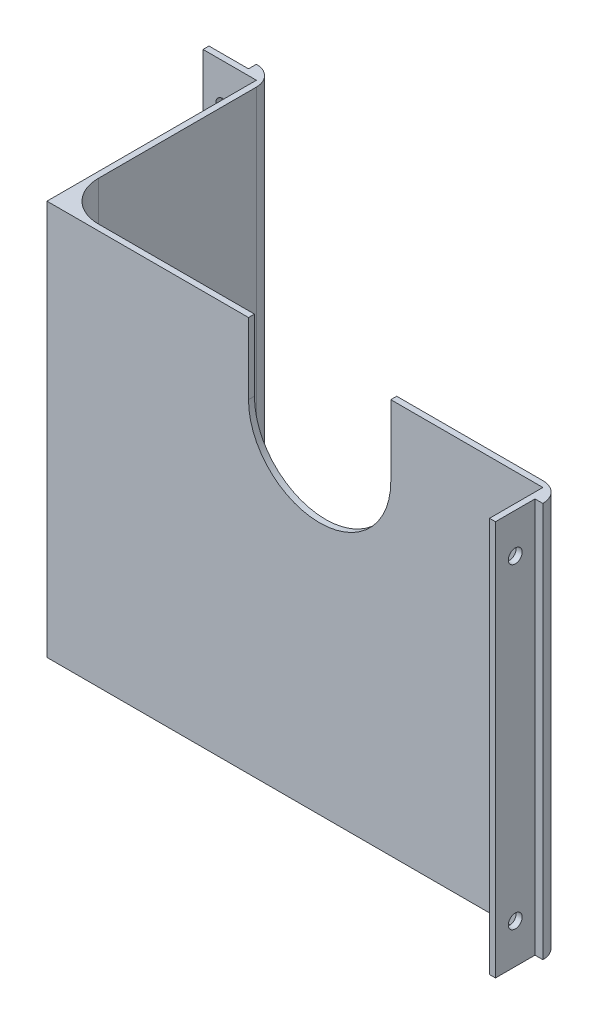
ISO-10303-21;
HEADER;
FILE_DESCRIPTION(('STEP AP214'),'2;1');
FILE_NAME('part.step','',(''),(''),'','','');
FILE_SCHEMA(('AUTOMOTIVE_DESIGN { 1 0 10303 214 1 1 1 1 }'));
ENDSEC;
DATA;
#1=APPLICATION_CONTEXT('core data for automotive mechanical design processes');
#2=APPLICATION_PROTOCOL_DEFINITION('international standard','automotive_design',2000,#1);
#3=PRODUCT_CONTEXT('',#1,'mechanical');
#4=PRODUCT('Part','Part','',(#3));
#5=PRODUCT_RELATED_PRODUCT_CATEGORY('part','',(#4));
#6=PRODUCT_DEFINITION_FORMATION('','',#4);
#7=PRODUCT_DEFINITION_CONTEXT('part definition',#1,'design');
#8=PRODUCT_DEFINITION('design','',#6,#7);
#9=PRODUCT_DEFINITION_SHAPE('','',#8);
#10=(LENGTH_UNIT() NAMED_UNIT(*) SI_UNIT(.MILLI.,.METRE.));
#11=(NAMED_UNIT(*) PLANE_ANGLE_UNIT() SI_UNIT($,.RADIAN.));
#12=(NAMED_UNIT(*) SI_UNIT($,.STERADIAN.) SOLID_ANGLE_UNIT());
#13=UNCERTAINTY_MEASURE_WITH_UNIT(LENGTH_MEASURE(1.E-05),#10,'distance_accuracy_value','');
#14=(GEOMETRIC_REPRESENTATION_CONTEXT(3) GLOBAL_UNCERTAINTY_ASSIGNED_CONTEXT((#13)) GLOBAL_UNIT_ASSIGNED_CONTEXT((#10,
#11,#12)) REPRESENTATION_CONTEXT('',''));
#15=CARTESIAN_POINT('',(0.,0.,0.));
#16=DIRECTION('',(0.,0.,1.));
#17=DIRECTION('',(1.,0.,0.));
#18=AXIS2_PLACEMENT_3D('',#15,#16,#17);
#19=CARTESIAN_POINT('',(-6.10622663543836E-13,100.,4.99999999999999));
#20=DIRECTION('',(0.,1.,0.));
#21=DIRECTION('',(0.,0.,-1.));
#22=AXIS2_PLACEMENT_3D('',#19,#20,#21);
#23=PLANE('',#22);
#24=DIRECTION('',(0.,0.,-1.));
#25=VECTOR('',#24,1.);
#26=CARTESIAN_POINT('',(-73.,100.,5.));
#27=LINE('',#26,#25);
#28=CARTESIAN_POINT('',(-73.,100.,1.5));
#29=VERTEX_POINT('',#28);
#30=CARTESIAN_POINT('',(-73.0000000000003,100.,0.));
#31=VERTEX_POINT('',#30);
#32=EDGE_CURVE('E11',#29,#31,#27,.T.);
#33=ORIENTED_EDGE('',*,*,#32,.T.);
#34=DIRECTION('',(1.,0.,0.));
#35=VECTOR('',#34,1.);
#36=CARTESIAN_POINT('',(0.,100.,0.));
#37=LINE('',#36,#35);
#38=CARTESIAN_POINT('',(-112.5,100.,0.));
#39=VERTEX_POINT('',#38);
#40=EDGE_CURVE('E185',#39,#31,#37,.T.);
#41=ORIENTED_EDGE('',*,*,#40,.F.);
#42=CARTESIAN_POINT('',(-112.5,100.,-10.));
#43=DIRECTION('',(0.,1.,0.));
#44=DIRECTION('',(0.,0.,-1.));
#45=AXIS2_PLACEMENT_3D('',#42,#43,#44);
#46=CIRCLE('',#45,9.99999999999999);
#47=CARTESIAN_POINT('',(-122.5,100.,-9.99999999999999));
#48=VERTEX_POINT('',#47);
#49=EDGE_CURVE('E167',#48,#39,#46,.T.);
#50=ORIENTED_EDGE('',*,*,#49,.F.);
#51=DIRECTION('',(0.,0.,1.));
#52=VECTOR('',#51,1.);
#53=CARTESIAN_POINT('',(-122.5,100.,-10.));
#54=LINE('',#53,#52);
#55=CARTESIAN_POINT('',(-122.5,100.,-50.));
#56=VERTEX_POINT('',#55);
#57=EDGE_CURVE('E176',#56,#48,#54,.T.);
#58=ORIENTED_EDGE('',*,*,#57,.F.);
#59=CARTESIAN_POINT('',(-127.5,100.,-50.));
#60=DIRECTION('',(0.,-1.,0.));
#61=DIRECTION('',(0.,0.,1.));
#62=AXIS2_PLACEMENT_3D('',#59,#60,#61);
#63=CIRCLE('',#62,5.00000000000001);
#64=CARTESIAN_POINT('',(-127.5,100.,-55.));
#65=VERTEX_POINT('',#64);
#66=EDGE_CURVE('E182',#65,#56,#63,.T.);
#67=ORIENTED_EDGE('',*,*,#66,.F.);
#68=DIRECTION('',(0.,0.,-1.));
#69=VECTOR('',#68,1.);
#70=CARTESIAN_POINT('',(-127.5,100.,-55.));
#71=LINE('',#70,#69);
#72=CARTESIAN_POINT('',(-127.5,100.,-53.));
#73=VERTEX_POINT('',#72);
#74=EDGE_CURVE('E334',#73,#65,#71,.T.);
#75=ORIENTED_EDGE('',*,*,#74,.F.);
#76=DIRECTION('',(1.,0.,0.));
#77=VECTOR('',#76,1.);
#78=CARTESIAN_POINT('',(-127.5,100.,-53.));
#79=LINE('',#78,#77);
#80=CARTESIAN_POINT('',(-137.5,100.,-53.));
#81=VERTEX_POINT('',#80);
#82=EDGE_CURVE('E331',#81,#73,#79,.T.);
#83=ORIENTED_EDGE('',*,*,#82,.F.);
#84=DIRECTION('',(0.,0.,-1.));
#85=VECTOR('',#84,1.);
#86=CARTESIAN_POINT('',(-137.5,100.,-53.));
#87=LINE('',#86,#85);
#88=CARTESIAN_POINT('',(-137.5,100.,-51.5));
#89=VERTEX_POINT('',#88);
#90=EDGE_CURVE('E328',#89,#81,#87,.T.);
#91=ORIENTED_EDGE('',*,*,#90,.F.);
#92=DIRECTION('',(-1.,0.,0.));
#93=VECTOR('',#92,1.);
#94=CARTESIAN_POINT('',(-137.5,100.,-51.5));
#95=LINE('',#94,#93);
#96=CARTESIAN_POINT('',(-124.,100.,-51.5));
#97=VERTEX_POINT('',#96);
#98=EDGE_CURVE('E325',#97,#89,#95,.T.);
#99=ORIENTED_EDGE('',*,*,#98,.F.);
#100=DIRECTION('',(0.,0.,-1.));
#101=VECTOR('',#100,1.);
#102=CARTESIAN_POINT('',(-124.,100.,-51.5));
#103=LINE('',#102,#101);
#104=CARTESIAN_POINT('',(-124.,100.,1.49999999999999));
#105=VERTEX_POINT('',#104);
#106=EDGE_CURVE('E322',#105,#97,#103,.T.);
#107=ORIENTED_EDGE('',*,*,#106,.F.);
#108=DIRECTION('',(-1.,0.,0.));
#109=VECTOR('',#108,1.);
#110=CARTESIAN_POINT('',(-124.,100.,1.49999999999999));
#111=LINE('',#110,#109);
#112=EDGE_CURVE('E318',#29,#105,#111,.T.);
#113=ORIENTED_EDGE('',*,*,#112,.F.);
#114=EDGE_LOOP('',(#33,#41,#50,#58,#67,#75,#83,#91,#99,#107,#113));
#115=FACE_BOUND('',#114,.T.);
#116=ADVANCED_FACE('F37',(#115),#23,.T.);
#117=CARTESIAN_POINT('',(-6.10622663543836E-13,100.,4.99999999999999));
#118=DIRECTION('',(0.,-1.,0.));
#119=DIRECTION('',(0.,0.,1.));
#120=AXIS2_PLACEMENT_3D('',#117,#118,#119);
#121=CYLINDRICAL_SURFACE('',#120,5.);
#122=CARTESIAN_POINT('',(-6.10622663543836E-13,3.05311331771918E-13,5.));
#123=DIRECTION('',(0.,-1.,0.));
#124=DIRECTION('',(0.,0.,-1.));
#125=AXIS2_PLACEMENT_3D('',#122,#123,#124);
#126=CIRCLE('',#125,5.);
#127=CARTESIAN_POINT('',(0.,0.,0.));
#128=VERTEX_POINT('',#127);
#129=CARTESIAN_POINT('',(4.99999999999939,3.05311331771918E-13,5.00000000000002));
#130=VERTEX_POINT('',#129);
#131=EDGE_CURVE('E191',#128,#130,#126,.T.);
#132=ORIENTED_EDGE('',*,*,#131,.F.);
#133=DIRECTION('',(0.,-1.,0.));
#134=VECTOR('',#133,1.);
#135=CARTESIAN_POINT('',(0.,100.,0.));
#136=LINE('',#135,#134);
#137=CARTESIAN_POINT('',(0.,100.,0.));
#138=VERTEX_POINT('',#137);
#139=EDGE_CURVE('E190',#138,#128,#136,.T.);
#140=ORIENTED_EDGE('',*,*,#139,.F.);
#141=CARTESIAN_POINT('',(-6.10622663543836E-13,100.,4.99999999999999));
#142=DIRECTION('',(0.,-1.,0.));
#143=DIRECTION('',(0.,0.,-1.));
#144=AXIS2_PLACEMENT_3D('',#141,#142,#143);
#145=CIRCLE('',#144,5.);
#146=CARTESIAN_POINT('',(4.99999999999939,100.,5.));
#147=VERTEX_POINT('',#146);
#148=EDGE_CURVE('E231',#138,#147,#145,.T.);
#149=ORIENTED_EDGE('',*,*,#148,.T.);
#150=DIRECTION('',(0.,-1.,0.));
#151=VECTOR('',#150,1.);
#152=CARTESIAN_POINT('',(4.99999999999939,100.,5.));
#153=LINE('',#152,#151);
#154=EDGE_CURVE('E265',#147,#130,#153,.T.);
#155=ORIENTED_EDGE('',*,*,#154,.T.);
#156=EDGE_LOOP('',(#132,#140,#149,#155));
#157=FACE_BOUND('',#156,.T.);
#158=ADVANCED_FACE('F39',(#157),#121,.T.);
#159=CARTESIAN_POINT('',(4.99999999999939,100.,5.));
#160=DIRECTION('',(0.,0.,-1.));
#161=DIRECTION('',(1.,0.,0.));
#162=AXIS2_PLACEMENT_3D('',#159,#160,#161);
#163=PLANE('',#162);
#164=DIRECTION('',(-1.,0.,0.));
#165=VECTOR('',#164,1.);
#166=CARTESIAN_POINT('',(4.99999999999939,3.05311331771918E-13,5.00000000000002));
#167=LINE('',#166,#165);
#168=CARTESIAN_POINT('',(2.99999999999939,3.05311331771918E-13,5.));
#169=VERTEX_POINT('',#168);
#170=EDGE_CURVE('E193',#130,#169,#167,.T.);
#171=ORIENTED_EDGE('',*,*,#170,.F.);
#172=ORIENTED_EDGE('',*,*,#154,.F.);
#173=DIRECTION('',(-1.,0.,0.));
#174=VECTOR('',#173,1.);
#175=CARTESIAN_POINT('',(4.99999999999939,100.,5.));
#176=LINE('',#175,#174);
#177=CARTESIAN_POINT('',(2.99999999999939,100.,5.));
#178=VERTEX_POINT('',#177);
#179=EDGE_CURVE('E123',#147,#178,#176,.T.);
#180=ORIENTED_EDGE('',*,*,#179,.T.);
#181=DIRECTION('',(0.,-1.,0.));
#182=VECTOR('',#181,1.);
#183=CARTESIAN_POINT('',(2.99999999999939,100.,5.));
#184=LINE('',#183,#182);
#185=EDGE_CURVE('E262',#178,#169,#184,.T.);
#186=ORIENTED_EDGE('',*,*,#185,.T.);
#187=EDGE_LOOP('',(#171,#172,#180,#186));
#188=FACE_BOUND('',#187,.T.);
#189=ADVANCED_FACE('F406',(#188),#163,.F.);
#190=CARTESIAN_POINT('',(2.99999999999939,100.,5.));
#191=DIRECTION('',(-1.,0.,0.));
#192=DIRECTION('',(0.,0.,-1.));
#193=AXIS2_PLACEMENT_3D('',#190,#191,#192);
#194=PLANE('',#193);
#195=CARTESIAN_POINT('',(2.99999999999998,90.,10.));
#196=DIRECTION('',(-1.,0.,0.));
#197=DIRECTION('',(0.,0.,1.));
#198=AXIS2_PLACEMENT_3D('',#195,#196,#197);
#199=CIRCLE('',#198,1.75);
#200=CARTESIAN_POINT('',(2.99999999999998,90.,11.75));
#201=VERTEX_POINT('',#200);
#202=EDGE_CURVE('E270',#201,#201,#199,.T.);
#203=ORIENTED_EDGE('',*,*,#202,.T.);
#204=EDGE_LOOP('',(#203));
#205=FACE_BOUND('',#204,.T.);
#206=CARTESIAN_POINT('',(2.99999999999998,9.99999999999999,10.));
#207=DIRECTION('',(-1.,0.,0.));
#208=DIRECTION('',(0.,0.,-1.));
#209=AXIS2_PLACEMENT_3D('',#206,#207,#208);
#210=CIRCLE('',#209,1.75);
#211=CARTESIAN_POINT('',(2.99999999999998,9.99999999999999,8.25000000000002));
#212=VERTEX_POINT('',#211);
#213=EDGE_CURVE('E276',#212,#212,#210,.T.);
#214=ORIENTED_EDGE('',*,*,#213,.T.);
#215=EDGE_LOOP('',(#214));
#216=FACE_BOUND('',#215,.T.);
#217=DIRECTION('',(0.,0.,1.));
#218=VECTOR('',#217,1.);
#219=CARTESIAN_POINT('',(2.99999999999939,3.05311331771918E-13,5.));
#220=LINE('',#219,#218);
#221=CARTESIAN_POINT('',(3.,3.05311331771918E-13,15.));
#222=VERTEX_POINT('',#221);
#223=EDGE_CURVE('E197',#169,#222,#220,.T.);
#224=ORIENTED_EDGE('',*,*,#223,.F.);
#225=ORIENTED_EDGE('',*,*,#185,.F.);
#226=DIRECTION('',(0.,0.,1.));
#227=VECTOR('',#226,1.);
#228=CARTESIAN_POINT('',(2.99999999999939,100.,5.));
#229=LINE('',#228,#227);
#230=CARTESIAN_POINT('',(3.,100.,15.));
#231=VERTEX_POINT('',#230);
#232=EDGE_CURVE('E309',#178,#231,#229,.T.);
#233=ORIENTED_EDGE('',*,*,#232,.T.);
#234=DIRECTION('',(0.,-1.,0.));
#235=VECTOR('',#234,1.);
#236=CARTESIAN_POINT('',(3.,100.,15.));
#237=LINE('',#236,#235);
#238=EDGE_CURVE('E259',#231,#222,#237,.T.);
#239=ORIENTED_EDGE('',*,*,#238,.T.);
#240=EDGE_LOOP('',(#224,#225,#233,#239));
#241=FACE_BOUND('',#240,.T.);
#242=ADVANCED_FACE('F444',(#205,#216,#241),#194,.F.);
#243=CARTESIAN_POINT('',(3.,100.,15.));
#244=DIRECTION('',(0.,0.,-1.));
#245=DIRECTION('',(1.,0.,0.));
#246=AXIS2_PLACEMENT_3D('',#243,#244,#245);
#247=PLANE('',#246);
#248=DIRECTION('',(-1.,0.,0.));
#249=VECTOR('',#248,1.);
#250=CARTESIAN_POINT('',(3.,3.05311331771918E-13,15.));
#251=LINE('',#250,#249);
#252=CARTESIAN_POINT('',(1.5,3.05311331771918E-13,15.));
#253=VERTEX_POINT('',#252);
#254=EDGE_CURVE('E200',#222,#253,#251,.T.);
#255=ORIENTED_EDGE('',*,*,#254,.F.);
#256=ORIENTED_EDGE('',*,*,#238,.F.);
#257=DIRECTION('',(-1.,0.,0.));
#258=VECTOR('',#257,1.);
#259=CARTESIAN_POINT('',(3.,100.,15.));
#260=LINE('',#259,#258);
#261=CARTESIAN_POINT('',(1.5,100.,15.));
#262=VERTEX_POINT('',#261);
#263=EDGE_CURVE('E312',#231,#262,#260,.T.);
#264=ORIENTED_EDGE('',*,*,#263,.T.);
#265=DIRECTION('',(0.,-1.,0.));
#266=VECTOR('',#265,1.);
#267=CARTESIAN_POINT('',(1.5,100.,15.));
#268=LINE('',#267,#266);
#269=EDGE_CURVE('E256',#262,#253,#268,.T.);
#270=ORIENTED_EDGE('',*,*,#269,.T.);
#271=EDGE_LOOP('',(#255,#256,#264,#270));
#272=FACE_BOUND('',#271,.T.);
#273=ADVANCED_FACE('F440',(#272),#247,.F.);
#274=CARTESIAN_POINT('',(1.5,100.,15.));
#275=DIRECTION('',(1.,0.,0.));
#276=DIRECTION('',(0.,0.,1.));
#277=AXIS2_PLACEMENT_3D('',#274,#275,#276);
#278=PLANE('',#277);
#279=CARTESIAN_POINT('',(1.49999999999997,90.,10.));
#280=DIRECTION('',(-1.,0.,0.));
#281=DIRECTION('',(0.,0.,1.));
#282=AXIS2_PLACEMENT_3D('',#279,#280,#281);
#283=CIRCLE('',#282,1.75);
#284=CARTESIAN_POINT('',(1.49999999999997,90.,11.75));
#285=VERTEX_POINT('',#284);
#286=EDGE_CURVE('E41',#285,#285,#283,.T.);
#287=ORIENTED_EDGE('',*,*,#286,.F.);
#288=EDGE_LOOP('',(#287));
#289=FACE_BOUND('',#288,.T.);
#290=CARTESIAN_POINT('',(1.49999999999997,9.99999999999999,10.));
#291=DIRECTION('',(-1.,0.,0.));
#292=DIRECTION('',(0.,0.,1.));
#293=AXIS2_PLACEMENT_3D('',#290,#291,#292);
#294=CIRCLE('',#293,1.75);
#295=CARTESIAN_POINT('',(1.49999999999997,9.99999999999999,11.75));
#296=VERTEX_POINT('',#295);
#297=EDGE_CURVE('E268',#296,#296,#294,.T.);
#298=ORIENTED_EDGE('',*,*,#297,.F.);
#299=EDGE_LOOP('',(#298));
#300=FACE_BOUND('',#299,.T.);
#301=DIRECTION('',(0.,0.,-1.));
#302=VECTOR('',#301,1.);
#303=CARTESIAN_POINT('',(1.5,3.05311331771918E-13,15.));
#304=LINE('',#303,#302);
#305=CARTESIAN_POINT('',(1.49999999999939,3.05311331771918E-13,1.5));
#306=VERTEX_POINT('',#305);
#307=EDGE_CURVE('E203',#253,#306,#304,.T.);
#308=ORIENTED_EDGE('',*,*,#307,.F.);
#309=ORIENTED_EDGE('',*,*,#269,.F.);
#310=DIRECTION('',(0.,0.,-1.));
#311=VECTOR('',#310,1.);
#312=CARTESIAN_POINT('',(1.5,100.,15.));
#313=LINE('',#312,#311);
#314=CARTESIAN_POINT('',(1.49999999999939,100.,1.5));
#315=VERTEX_POINT('',#314);
#316=EDGE_CURVE('E315',#262,#315,#313,.T.);
#317=ORIENTED_EDGE('',*,*,#316,.T.);
#318=DIRECTION('',(0.,-1.,0.));
#319=VECTOR('',#318,1.);
#320=CARTESIAN_POINT('',(1.49999999999939,100.,1.5));
#321=LINE('',#320,#319);
#322=EDGE_CURVE('E253',#315,#306,#321,.T.);
#323=ORIENTED_EDGE('',*,*,#322,.T.);
#324=EDGE_LOOP('',(#308,#309,#317,#323));
#325=FACE_BOUND('',#324,.T.);
#326=ADVANCED_FACE('F375',(#289,#300,#325),#278,.F.);
#327=CARTESIAN_POINT('',(-124.,100.,1.49999999999999));
#328=DIRECTION('',(0.,0.,-1.));
#329=DIRECTION('',(1.,0.,0.));
#330=AXIS2_PLACEMENT_3D('',#327,#328,#329);
#331=PLANE('',#330);
#332=ORIENTED_EDGE('',*,*,#112,.T.);
#333=DIRECTION('',(0.,-1.,0.));
#334=VECTOR('',#333,1.);
#335=CARTESIAN_POINT('',(-124.,100.,1.49999999999999));
#336=LINE('',#335,#334);
#337=CARTESIAN_POINT('',(-124.,3.05311331771918E-13,1.5));
#338=VERTEX_POINT('',#337);
#339=EDGE_CURVE('E250',#105,#338,#336,.T.);
#340=ORIENTED_EDGE('',*,*,#339,.T.);
#341=DIRECTION('',(-1.,0.,0.));
#342=VECTOR('',#341,1.);
#343=CARTESIAN_POINT('',(-124.,3.05311331771918E-13,1.5));
#344=LINE('',#343,#342);
#345=EDGE_CURVE('E206',#306,#338,#344,.T.);
#346=ORIENTED_EDGE('',*,*,#345,.F.);
#347=ORIENTED_EDGE('',*,*,#322,.F.);
#348=CARTESIAN_POINT('',(-37.,100.,1.5));
#349=VERTEX_POINT('',#348);
#350=EDGE_CURVE('E319',#315,#349,#111,.T.);
#351=ORIENTED_EDGE('',*,*,#350,.T.);
#352=DIRECTION('',(0.,1.,0.));
#353=VECTOR('',#352,1.);
#354=CARTESIAN_POINT('',(-37.,100.,1.5));
#355=LINE('',#354,#353);
#356=CARTESIAN_POINT('',(-37.,82.0000017227817,1.5));
#357=VERTEX_POINT('',#356);
#358=EDGE_CURVE('E297',#357,#349,#355,.T.);
#359=ORIENTED_EDGE('',*,*,#358,.F.);
#360=CARTESIAN_POINT('',(-55.,82.0000008613909,1.5));
#361=DIRECTION('',(0.,0.,1.));
#362=DIRECTION('',(1.,0.,0.));
#363=AXIS2_PLACEMENT_3D('',#360,#361,#362);
#364=CIRCLE('',#363,18.);
#365=CARTESIAN_POINT('',(-73.,82.,1.5));
#366=VERTEX_POINT('',#365);
#367=EDGE_CURVE('E194',#366,#357,#364,.T.);
#368=ORIENTED_EDGE('',*,*,#367,.F.);
#369=DIRECTION('',(0.,-1.,0.));
#370=VECTOR('',#369,1.);
#371=CARTESIAN_POINT('',(-73.,100.,1.5));
#372=LINE('',#371,#370);
#373=EDGE_CURVE('E301',#29,#366,#372,.T.);
#374=ORIENTED_EDGE('',*,*,#373,.F.);
#375=EDGE_LOOP('',(#332,#340,#346,#347,#351,#359,#368,#374));
#376=FACE_BOUND('',#375,.T.);
#377=ADVANCED_FACE('F357',(#376),#331,.F.);
#378=CARTESIAN_POINT('',(-124.,100.,-51.5));
#379=DIRECTION('',(1.,0.,0.));
#380=DIRECTION('',(0.,0.,1.));
#381=AXIS2_PLACEMENT_3D('',#378,#379,#380);
#382=PLANE('',#381);
#383=DIRECTION('',(0.,0.,-1.));
#384=VECTOR('',#383,1.);
#385=CARTESIAN_POINT('',(-124.,0.,-51.5));
#386=LINE('',#385,#384);
#387=CARTESIAN_POINT('',(-124.,0.,-51.5));
#388=VERTEX_POINT('',#387);
#389=EDGE_CURVE('E209',#338,#388,#386,.T.);
#390=ORIENTED_EDGE('',*,*,#389,.F.);
#391=ORIENTED_EDGE('',*,*,#339,.F.);
#392=ORIENTED_EDGE('',*,*,#106,.T.);
#393=DIRECTION('',(0.,-1.,0.));
#394=VECTOR('',#393,1.);
#395=CARTESIAN_POINT('',(-124.,100.,-51.5));
#396=LINE('',#395,#394);
#397=EDGE_CURVE('E247',#97,#388,#396,.T.);
#398=ORIENTED_EDGE('',*,*,#397,.T.);
#399=EDGE_LOOP('',(#390,#391,#392,#398));
#400=FACE_BOUND('',#399,.T.);
#401=ADVANCED_FACE('F353',(#400),#382,.F.);
#402=CARTESIAN_POINT('',(-137.5,100.,-51.5));
#403=DIRECTION('',(0.,0.,-1.));
#404=DIRECTION('',(1.,0.,0.));
#405=AXIS2_PLACEMENT_3D('',#402,#403,#404);
#406=PLANE('',#405);
#407=CARTESIAN_POINT('',(-132.5,90.,-51.5));
#408=DIRECTION('',(0.,0.,1.));
#409=DIRECTION('',(1.,0.,0.));
#410=AXIS2_PLACEMENT_3D('',#407,#408,#409);
#411=CIRCLE('',#410,1.75000000000001);
#412=CARTESIAN_POINT('',(-130.75,90.,-51.5));
#413=VERTEX_POINT('',#412);
#414=EDGE_CURVE('E281',#413,#413,#411,.T.);
#415=ORIENTED_EDGE('',*,*,#414,.F.);
#416=EDGE_LOOP('',(#415));
#417=FACE_BOUND('',#416,.T.);
#418=CARTESIAN_POINT('',(-132.5,9.99999999999999,-51.5));
#419=DIRECTION('',(0.,0.,1.));
#420=DIRECTION('',(1.,0.,0.));
#421=AXIS2_PLACEMENT_3D('',#418,#419,#420);
#422=CIRCLE('',#421,1.75000000000001);
#423=CARTESIAN_POINT('',(-130.75,9.99999999999999,-51.5));
#424=VERTEX_POINT('',#423);
#425=EDGE_CURVE('E581',#424,#424,#422,.T.);
#426=ORIENTED_EDGE('',*,*,#425,.F.);
#427=EDGE_LOOP('',(#426));
#428=FACE_BOUND('',#427,.T.);
#429=DIRECTION('',(-1.,0.,0.));
#430=VECTOR('',#429,1.);
#431=CARTESIAN_POINT('',(-137.5,0.,-51.5));
#432=LINE('',#431,#430);
#433=CARTESIAN_POINT('',(-137.5,0.,-51.5));
#434=VERTEX_POINT('',#433);
#435=EDGE_CURVE('E212',#388,#434,#432,.T.);
#436=ORIENTED_EDGE('',*,*,#435,.F.);
#437=ORIENTED_EDGE('',*,*,#397,.F.);
#438=ORIENTED_EDGE('',*,*,#98,.T.);
#439=DIRECTION('',(0.,-1.,0.));
#440=VECTOR('',#439,1.);
#441=CARTESIAN_POINT('',(-137.5,100.,-51.5));
#442=LINE('',#441,#440);
#443=EDGE_CURVE('E244',#89,#434,#442,.T.);
#444=ORIENTED_EDGE('',*,*,#443,.T.);
#445=EDGE_LOOP('',(#436,#437,#438,#444));
#446=FACE_BOUND('',#445,.T.);
#447=ADVANCED_FACE('F351',(#417,#428,#446),#406,.F.);
#448=CARTESIAN_POINT('',(-137.5,100.,-53.));
#449=DIRECTION('',(1.,0.,0.));
#450=DIRECTION('',(0.,0.,1.));
#451=AXIS2_PLACEMENT_3D('',#448,#449,#450);
#452=PLANE('',#451);
#453=DIRECTION('',(0.,0.,-1.));
#454=VECTOR('',#453,1.);
#455=CARTESIAN_POINT('',(-137.5,0.,-53.));
#456=LINE('',#455,#454);
#457=CARTESIAN_POINT('',(-137.5,0.,-53.));
#458=VERTEX_POINT('',#457);
#459=EDGE_CURVE('E215',#434,#458,#456,.T.);
#460=ORIENTED_EDGE('',*,*,#459,.F.);
#461=ORIENTED_EDGE('',*,*,#443,.F.);
#462=ORIENTED_EDGE('',*,*,#90,.T.);
#463=DIRECTION('',(0.,-1.,0.));
#464=VECTOR('',#463,1.);
#465=CARTESIAN_POINT('',(-137.5,100.,-53.));
#466=LINE('',#465,#464);
#467=EDGE_CURVE('E241',#81,#458,#466,.T.);
#468=ORIENTED_EDGE('',*,*,#467,.T.);
#469=EDGE_LOOP('',(#460,#461,#462,#468));
#470=FACE_BOUND('',#469,.T.);
#471=ADVANCED_FACE('F346',(#470),#452,.F.);
#472=CARTESIAN_POINT('',(-127.5,100.,-53.));
#473=DIRECTION('',(0.,0.,1.));
#474=DIRECTION('',(-1.,0.,0.));
#475=AXIS2_PLACEMENT_3D('',#472,#473,#474);
#476=PLANE('',#475);
#477=CARTESIAN_POINT('',(-132.5,90.,-53.0000000000001));
#478=DIRECTION('',(0.,0.,1.));
#479=DIRECTION('',(1.,0.,0.));
#480=AXIS2_PLACEMENT_3D('',#477,#478,#479);
#481=CIRCLE('',#480,1.75000000000001);
#482=CARTESIAN_POINT('',(-130.75,90.,-53.0000000000001));
#483=VERTEX_POINT('',#482);
#484=EDGE_CURVE('E578',#483,#483,#481,.T.);
#485=ORIENTED_EDGE('',*,*,#484,.T.);
#486=EDGE_LOOP('',(#485));
#487=FACE_BOUND('',#486,.T.);
#488=CARTESIAN_POINT('',(-132.5,9.99999999999999,-53.0000000000001));
#489=DIRECTION('',(0.,0.,1.));
#490=DIRECTION('',(-1.,0.,0.));
#491=AXIS2_PLACEMENT_3D('',#488,#489,#490);
#492=CIRCLE('',#491,1.75000000000001);
#493=CARTESIAN_POINT('',(-134.25,9.99999999999999,-53.0000000000001));
#494=VERTEX_POINT('',#493);
#495=EDGE_CURVE('E585',#494,#494,#492,.T.);
#496=ORIENTED_EDGE('',*,*,#495,.T.);
#497=EDGE_LOOP('',(#496));
#498=FACE_BOUND('',#497,.T.);
#499=DIRECTION('',(1.,0.,0.));
#500=VECTOR('',#499,1.);
#501=CARTESIAN_POINT('',(-127.5,0.,-53.));
#502=LINE('',#501,#500);
#503=CARTESIAN_POINT('',(-127.5,0.,-53.));
#504=VERTEX_POINT('',#503);
#505=EDGE_CURVE('E218',#458,#504,#502,.T.);
#506=ORIENTED_EDGE('',*,*,#505,.F.);
#507=ORIENTED_EDGE('',*,*,#467,.F.);
#508=ORIENTED_EDGE('',*,*,#82,.T.);
#509=DIRECTION('',(0.,-1.,0.));
#510=VECTOR('',#509,1.);
#511=CARTESIAN_POINT('',(-127.5,100.,-53.));
#512=LINE('',#511,#510);
#513=EDGE_CURVE('E238',#73,#504,#512,.T.);
#514=ORIENTED_EDGE('',*,*,#513,.T.);
#515=EDGE_LOOP('',(#506,#507,#508,#514));
#516=FACE_BOUND('',#515,.T.);
#517=ADVANCED_FACE('F344',(#487,#498,#516),#476,.F.);
#518=CARTESIAN_POINT('',(-127.5,100.,-55.));
#519=DIRECTION('',(1.,0.,0.));
#520=DIRECTION('',(0.,0.,1.));
#521=AXIS2_PLACEMENT_3D('',#518,#519,#520);
#522=PLANE('',#521);
#523=DIRECTION('',(0.,0.,-1.));
#524=VECTOR('',#523,1.);
#525=CARTESIAN_POINT('',(-127.5,0.,-55.));
#526=LINE('',#525,#524);
#527=CARTESIAN_POINT('',(-127.5,0.,-55.));
#528=VERTEX_POINT('',#527);
#529=EDGE_CURVE('E221',#504,#528,#526,.T.);
#530=ORIENTED_EDGE('',*,*,#529,.F.);
#531=ORIENTED_EDGE('',*,*,#513,.F.);
#532=ORIENTED_EDGE('',*,*,#74,.T.);
#533=DIRECTION('',(0.,-1.,0.));
#534=VECTOR('',#533,1.);
#535=CARTESIAN_POINT('',(-127.5,100.,-55.));
#536=LINE('',#535,#534);
#537=EDGE_CURVE('E235',#65,#528,#536,.T.);
#538=ORIENTED_EDGE('',*,*,#537,.T.);
#539=EDGE_LOOP('',(#530,#531,#532,#538));
#540=FACE_BOUND('',#539,.T.);
#541=ADVANCED_FACE('F342',(#540),#522,.F.);
#542=CARTESIAN_POINT('',(-127.5,100.,-50.));
#543=DIRECTION('',(0.,-1.,0.));
#544=DIRECTION('',(0.,0.,1.));
#545=AXIS2_PLACEMENT_3D('',#542,#543,#544);
#546=CYLINDRICAL_SURFACE('',#545,5.00000000000001);
#547=CARTESIAN_POINT('',(-127.5,3.05311331771918E-13,-50.));
#548=DIRECTION('',(0.,-1.,0.));
#549=DIRECTION('',(0.,0.,1.));
#550=AXIS2_PLACEMENT_3D('',#547,#548,#549);
#551=CIRCLE('',#550,5.00000000000001);
#552=CARTESIAN_POINT('',(-122.5,3.05311331771918E-13,-50.));
#553=VERTEX_POINT('',#552);
#554=EDGE_CURVE('E224',#528,#553,#551,.T.);
#555=ORIENTED_EDGE('',*,*,#554,.F.);
#556=ORIENTED_EDGE('',*,*,#537,.F.);
#557=ORIENTED_EDGE('',*,*,#66,.T.);
#558=DIRECTION('',(0.,-1.,0.));
#559=VECTOR('',#558,1.);
#560=CARTESIAN_POINT('',(-122.5,100.,-50.));
#561=LINE('',#560,#559);
#562=EDGE_CURVE('E172',#56,#553,#561,.T.);
#563=ORIENTED_EDGE('',*,*,#562,.T.);
#564=EDGE_LOOP('',(#555,#556,#557,#563));
#565=FACE_BOUND('',#564,.T.);
#566=ADVANCED_FACE('F337',(#565),#546,.T.);
#567=CARTESIAN_POINT('',(-122.5,100.,-10.));
#568=DIRECTION('',(-1.,0.,0.));
#569=DIRECTION('',(0.,0.,-1.));
#570=AXIS2_PLACEMENT_3D('',#567,#568,#569);
#571=PLANE('',#570);
#572=DIRECTION('',(0.,0.,1.));
#573=VECTOR('',#572,1.);
#574=CARTESIAN_POINT('',(-122.5,0.,-10.));
#575=LINE('',#574,#573);
#576=CARTESIAN_POINT('',(-122.5,0.,-10.));
#577=VERTEX_POINT('',#576);
#578=EDGE_CURVE('E227',#553,#577,#575,.T.);
#579=ORIENTED_EDGE('',*,*,#578,.F.);
#580=ORIENTED_EDGE('',*,*,#562,.F.);
#581=ORIENTED_EDGE('',*,*,#57,.T.);
#582=DIRECTION('',(0.,-1.,0.));
#583=VECTOR('',#582,1.);
#584=CARTESIAN_POINT('',(-122.5,100.,-9.99999999999999));
#585=LINE('',#584,#583);
#586=EDGE_CURVE('E162',#48,#577,#585,.T.);
#587=ORIENTED_EDGE('',*,*,#586,.T.);
#588=EDGE_LOOP('',(#579,#580,#581,#587));
#589=FACE_BOUND('',#588,.T.);
#590=ADVANCED_FACE('F177',(#589),#571,.F.);
#591=CARTESIAN_POINT('',(-112.5,100.,-10.));
#592=DIRECTION('',(0.,-1.,0.));
#593=DIRECTION('',(0.,0.,1.));
#594=AXIS2_PLACEMENT_3D('',#591,#592,#593);
#595=CYLINDRICAL_SURFACE('',#594,9.99999999999999);
#596=CARTESIAN_POINT('',(-112.5,0.,-10.));
#597=DIRECTION('',(0.,1.,0.));
#598=DIRECTION('',(0.,0.,-1.));
#599=AXIS2_PLACEMENT_3D('',#596,#597,#598);
#600=CIRCLE('',#599,9.99999999999999);
#601=CARTESIAN_POINT('',(-112.5,0.,0.));
#602=VERTEX_POINT('',#601);
#603=EDGE_CURVE('E169',#577,#602,#600,.T.);
#604=ORIENTED_EDGE('',*,*,#603,.F.);
#605=ORIENTED_EDGE('',*,*,#586,.F.);
#606=ORIENTED_EDGE('',*,*,#49,.T.);
#607=DIRECTION('',(0.,-1.,0.));
#608=VECTOR('',#607,1.);
#609=CARTESIAN_POINT('',(-112.5,100.,0.));
#610=LINE('',#609,#608);
#611=EDGE_CURVE('E173',#39,#602,#610,.T.);
#612=ORIENTED_EDGE('',*,*,#611,.T.);
#613=EDGE_LOOP('',(#604,#605,#606,#612));
#614=FACE_BOUND('',#613,.T.);
#615=ADVANCED_FACE('F164',(#614),#595,.F.);
#616=CARTESIAN_POINT('',(0.,100.,0.));
#617=DIRECTION('',(0.,0.,1.));
#618=DIRECTION('',(-1.,0.,0.));
#619=AXIS2_PLACEMENT_3D('',#616,#617,#618);
#620=PLANE('',#619);
#621=CARTESIAN_POINT('',(-55.,82.0000008613909,0.));
#622=DIRECTION('',(0.,0.,1.));
#623=DIRECTION('',(1.,0.,0.));
#624=AXIS2_PLACEMENT_3D('',#621,#622,#623);
#625=CIRCLE('',#624,18.);
#626=CARTESIAN_POINT('',(-73.0000000000003,82.,0.));
#627=VERTEX_POINT('',#626);
#628=CARTESIAN_POINT('',(-37.,82.0000017227817,0.));
#629=VERTEX_POINT('',#628);
#630=EDGE_CURVE('E274',#627,#629,#625,.T.);
#631=ORIENTED_EDGE('',*,*,#630,.T.);
#632=DIRECTION('',(0.,1.,0.));
#633=VECTOR('',#632,1.);
#634=CARTESIAN_POINT('',(-37.,100.,0.));
#635=LINE('',#634,#633);
#636=CARTESIAN_POINT('',(-37.,100.,0.));
#637=VERTEX_POINT('',#636);
#638=EDGE_CURVE('E288',#629,#637,#635,.T.);
#639=ORIENTED_EDGE('',*,*,#638,.T.);
#640=EDGE_CURVE('E61',#637,#138,#37,.T.);
#641=ORIENTED_EDGE('',*,*,#640,.T.);
#642=ORIENTED_EDGE('',*,*,#139,.T.);
#643=DIRECTION('',(1.,0.,0.));
#644=VECTOR('',#643,1.);
#645=CARTESIAN_POINT('',(0.,0.,0.));
#646=LINE('',#645,#644);
#647=EDGE_CURVE('E116',#602,#128,#646,.T.);
#648=ORIENTED_EDGE('',*,*,#647,.F.);
#649=ORIENTED_EDGE('',*,*,#611,.F.);
#650=ORIENTED_EDGE('',*,*,#40,.T.);
#651=DIRECTION('',(0.,-1.,0.));
#652=VECTOR('',#651,1.);
#653=CARTESIAN_POINT('',(-73.0000000000003,82.,0.));
#654=LINE('',#653,#652);
#655=EDGE_CURVE('E290',#31,#627,#654,.T.);
#656=ORIENTED_EDGE('',*,*,#655,.T.);
#657=EDGE_LOOP('',(#631,#639,#641,#642,#648,#649,#650,#656));
#658=FACE_BOUND('',#657,.T.);
#659=ADVANCED_FACE('F371',(#658),#620,.F.);
#660=DIRECTION('',(0.,0.,1.));
#661=VECTOR('',#660,1.);
#662=CARTESIAN_POINT('',(-37.0000000000006,100.,5.));
#663=LINE('',#662,#661);
#664=EDGE_CURVE('E46',#637,#349,#663,.T.);
#665=ORIENTED_EDGE('',*,*,#664,.T.);
#666=ORIENTED_EDGE('',*,*,#350,.F.);
#667=ORIENTED_EDGE('',*,*,#316,.F.);
#668=ORIENTED_EDGE('',*,*,#263,.F.);
#669=ORIENTED_EDGE('',*,*,#232,.F.);
#670=ORIENTED_EDGE('',*,*,#179,.F.);
#671=ORIENTED_EDGE('',*,*,#148,.F.);
#672=ORIENTED_EDGE('',*,*,#640,.F.);
#673=EDGE_LOOP('',(#665,#666,#667,#668,#669,#670,#671,#672));
#674=FACE_BOUND('',#673,.T.);
#675=ADVANCED_FACE('F377',(#674),#23,.T.);
#676=CARTESIAN_POINT('',(-6.10622663543836E-13,3.05311331771918E-13,5.));
#677=DIRECTION('',(0.,1.,0.));
#678=DIRECTION('',(0.,0.,-1.));
#679=AXIS2_PLACEMENT_3D('',#676,#677,#678);
#680=PLANE('',#679);
#681=ORIENTED_EDGE('',*,*,#131,.T.);
#682=ORIENTED_EDGE('',*,*,#170,.T.);
#683=ORIENTED_EDGE('',*,*,#223,.T.);
#684=ORIENTED_EDGE('',*,*,#254,.T.);
#685=ORIENTED_EDGE('',*,*,#307,.T.);
#686=ORIENTED_EDGE('',*,*,#345,.T.);
#687=ORIENTED_EDGE('',*,*,#389,.T.);
#688=ORIENTED_EDGE('',*,*,#435,.T.);
#689=ORIENTED_EDGE('',*,*,#459,.T.);
#690=ORIENTED_EDGE('',*,*,#505,.T.);
#691=ORIENTED_EDGE('',*,*,#529,.T.);
#692=ORIENTED_EDGE('',*,*,#554,.T.);
#693=ORIENTED_EDGE('',*,*,#578,.T.);
#694=ORIENTED_EDGE('',*,*,#603,.T.);
#695=ORIENTED_EDGE('',*,*,#647,.T.);
#696=EDGE_LOOP('',(#681,#682,#683,#684,#685,#686,#687,#688,#689,#690,#691,#692,#693,#694,#695));
#697=FACE_BOUND('',#696,.T.);
#698=ADVANCED_FACE('F372',(#697),#680,.F.);
#699=CARTESIAN_POINT('',(-55.,82.0000008613909,10.));
#700=DIRECTION('',(0.,0.,-1.));
#701=DIRECTION('',(1.,0.,0.));
#702=AXIS2_PLACEMENT_3D('',#699,#700,#701);
#703=CYLINDRICAL_SURFACE('',#702,18.);
#704=DIRECTION('',(0.,0.,-1.));
#705=VECTOR('',#704,1.);
#706=CARTESIAN_POINT('',(-73.0000000000003,82.,10.));
#707=LINE('',#706,#705);
#708=EDGE_CURVE('E294',#366,#627,#707,.T.);
#709=ORIENTED_EDGE('',*,*,#708,.F.);
#710=ORIENTED_EDGE('',*,*,#367,.T.);
#711=DIRECTION('',(0.,0.,-1.));
#712=VECTOR('',#711,1.);
#713=CARTESIAN_POINT('',(-37.,82.0000017227817,10.));
#714=LINE('',#713,#712);
#715=EDGE_CURVE('E293',#357,#629,#714,.T.);
#716=ORIENTED_EDGE('',*,*,#715,.T.);
#717=ORIENTED_EDGE('',*,*,#630,.F.);
#718=EDGE_LOOP('',(#709,#710,#716,#717));
#719=FACE_BOUND('',#718,.T.);
#720=ADVANCED_FACE('F387',(#719),#703,.F.);
#721=CARTESIAN_POINT('',(-73.0000000000003,82.,10.));
#722=DIRECTION('',(-1.,0.,0.));
#723=DIRECTION('',(0.,0.,-1.));
#724=AXIS2_PLACEMENT_3D('',#721,#722,#723);
#725=PLANE('',#724);
#726=ORIENTED_EDGE('',*,*,#32,.F.);
#727=ORIENTED_EDGE('',*,*,#373,.T.);
#728=ORIENTED_EDGE('',*,*,#708,.T.);
#729=ORIENTED_EDGE('',*,*,#655,.F.);
#730=EDGE_LOOP('',(#726,#727,#728,#729));
#731=FACE_BOUND('',#730,.T.);
#732=ADVANCED_FACE('F365',(#731),#725,.F.);
#733=CARTESIAN_POINT('',(-37.,100.,10.));
#734=DIRECTION('',(1.,0.,0.));
#735=DIRECTION('',(0.,0.,1.));
#736=AXIS2_PLACEMENT_3D('',#733,#734,#735);
#737=PLANE('',#736);
#738=ORIENTED_EDGE('',*,*,#715,.F.);
#739=ORIENTED_EDGE('',*,*,#358,.T.);
#740=ORIENTED_EDGE('',*,*,#664,.F.);
#741=ORIENTED_EDGE('',*,*,#638,.F.);
#742=EDGE_LOOP('',(#738,#739,#740,#741));
#743=FACE_BOUND('',#742,.T.);
#744=ADVANCED_FACE('F388',(#743),#737,.F.);
#745=CARTESIAN_POINT('',(-7.00000000000001,9.99999999999999,10.));
#746=DIRECTION('',(1.,0.,0.));
#747=DIRECTION('',(0.,0.,1.));
#748=AXIS2_PLACEMENT_3D('',#745,#746,#747);
#749=CYLINDRICAL_SURFACE('',#748,1.75);
#750=ORIENTED_EDGE('',*,*,#213,.F.);
#751=EDGE_LOOP('',(#750));
#752=FACE_BOUND('',#751,.T.);
#753=ORIENTED_EDGE('',*,*,#297,.T.);
#754=EDGE_LOOP('',(#753));
#755=FACE_BOUND('',#754,.T.);
#756=ADVANCED_FACE('F390',(#752,#755),#749,.F.);
#757=CARTESIAN_POINT('',(-7.00000000000001,90.,10.));
#758=DIRECTION('',(1.,0.,0.));
#759=DIRECTION('',(0.,0.,1.));
#760=AXIS2_PLACEMENT_3D('',#757,#758,#759);
#761=CYLINDRICAL_SURFACE('',#760,1.75);
#762=ORIENTED_EDGE('',*,*,#202,.F.);
#763=EDGE_LOOP('',(#762));
#764=FACE_BOUND('',#763,.T.);
#765=ORIENTED_EDGE('',*,*,#286,.T.);
#766=EDGE_LOOP('',(#765));
#767=FACE_BOUND('',#766,.T.);
#768=ADVANCED_FACE('F396',(#764,#767),#761,.F.);
#769=CARTESIAN_POINT('',(-132.5,9.99999999999999,-43.0000000000001));
#770=DIRECTION('',(0.,0.,-1.));
#771=DIRECTION('',(1.,0.,0.));
#772=AXIS2_PLACEMENT_3D('',#769,#770,#771);
#773=CYLINDRICAL_SURFACE('',#772,1.75000000000001);
#774=ORIENTED_EDGE('',*,*,#495,.F.);
#775=EDGE_LOOP('',(#774));
#776=FACE_BOUND('',#775,.T.);
#777=ORIENTED_EDGE('',*,*,#425,.T.);
#778=EDGE_LOOP('',(#777));
#779=FACE_BOUND('',#778,.T.);
#780=ADVANCED_FACE('F551',(#776,#779),#773,.F.);
#781=CARTESIAN_POINT('',(-132.5,90.,-43.0000000000001));
#782=DIRECTION('',(0.,0.,-1.));
#783=DIRECTION('',(1.,0.,0.));
#784=AXIS2_PLACEMENT_3D('',#781,#782,#783);
#785=CYLINDRICAL_SURFACE('',#784,1.75000000000001);
#786=ORIENTED_EDGE('',*,*,#484,.F.);
#787=EDGE_LOOP('',(#786));
#788=FACE_BOUND('',#787,.T.);
#789=ORIENTED_EDGE('',*,*,#414,.T.);
#790=EDGE_LOOP('',(#789));
#791=FACE_BOUND('',#790,.T.);
#792=ADVANCED_FACE('F561',(#788,#791),#785,.F.);
#793=CLOSED_SHELL('',(#116,#158,#189,#242,#273,#326,#377,#401,#447,#471,#517,#541,#566,#590,
#615,#659,#675,#698,#720,#732,#744,#756,#768,#780,#792));
#794=MANIFOLD_SOLID_BREP('B2',#793);
#795=ADVANCED_BREP_SHAPE_REPRESENTATION('',(#18,#794),#14);
#796=SHAPE_DEFINITION_REPRESENTATION(#9,#795);
ENDSEC;
END-ISO-10303-21;
